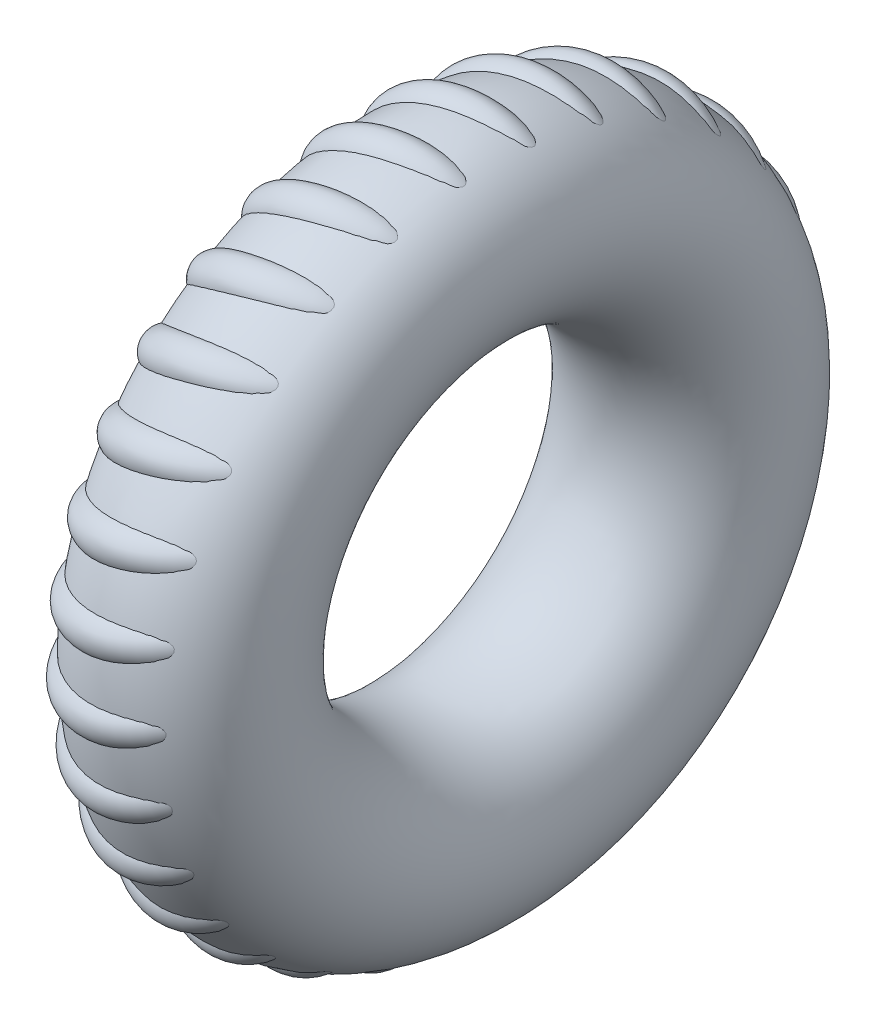
ISO-10303-21;
HEADER;
FILE_DESCRIPTION(('STEP AP214'),'2;1');
FILE_NAME('part.step','',(''),(''),'','','');
FILE_SCHEMA(('AUTOMOTIVE_DESIGN { 1 0 10303 214 1 1 1 1 }'));
ENDSEC;
DATA;
#1=APPLICATION_CONTEXT('core data for automotive mechanical design processes');
#2=APPLICATION_PROTOCOL_DEFINITION('international standard','automotive_design',2000,#1);
#3=PRODUCT_CONTEXT('',#1,'mechanical');
#4=PRODUCT('Part','Part','',(#3));
#5=PRODUCT_RELATED_PRODUCT_CATEGORY('part','',(#4));
#6=PRODUCT_DEFINITION_FORMATION('','',#4);
#7=PRODUCT_DEFINITION_CONTEXT('part definition',#1,'design');
#8=PRODUCT_DEFINITION('design','',#6,#7);
#9=PRODUCT_DEFINITION_SHAPE('','',#8);
#10=(LENGTH_UNIT() NAMED_UNIT(*) SI_UNIT(.MILLI.,.METRE.));
#11=(NAMED_UNIT(*) PLANE_ANGLE_UNIT() SI_UNIT($,.RADIAN.));
#12=(NAMED_UNIT(*) SI_UNIT($,.STERADIAN.) SOLID_ANGLE_UNIT());
#13=UNCERTAINTY_MEASURE_WITH_UNIT(LENGTH_MEASURE(1.E-05),#10,'distance_accuracy_value','');
#14=(GEOMETRIC_REPRESENTATION_CONTEXT(3) GLOBAL_UNCERTAINTY_ASSIGNED_CONTEXT((#13)) GLOBAL_UNIT_ASSIGNED_CONTEXT((#10,
#11,#12)) REPRESENTATION_CONTEXT('',''));
#15=CARTESIAN_POINT('',(0.,0.,0.));
#16=DIRECTION('',(0.,0.,1.));
#17=DIRECTION('',(1.,0.,0.));
#18=AXIS2_PLACEMENT_3D('',#15,#16,#17);
#19=CARTESIAN_POINT('',(-0.0197356871410223,0.807315676540403,-0.286027395869337));
#20=DIRECTION('',(0.171928492592131,0.0654062565493844,0.982935712566795));
#21=DIRECTION('',(-0.0243779212002063,-0.997205374978752,0.0706198065095223));
#22=AXIS2_PLACEMENT_3D('',#19,#20,#21);
#23=TOROIDAL_SURFACE('',#22,0.234974875549106,0.0673045788176516);
#24=CARTESIAN_POINT('',(-0.0271046318600165,0.505880979900229,-0.264680479290153));
#25=VERTEX_POINT('',#24);
#26=VERTEX_LOOP('',#25);
#27=FACE_BOUND('',#26,.T.);
#28=ADVANCED_FACE('F43',(#27),#23,.T.);
#29=CLOSED_SHELL('',(#28));
#30=MANIFOLD_SOLID_BREP('B2',#29);
#31=CARTESIAN_POINT('',(-0.0197356871410223,0.73020545254739,-0.447627378346929));
#32=DIRECTION('',(0.171928492592131,0.268340798881682,0.947857483533542));
#33=DIRECTION('',(-0.0243779212002063,-0.960731361597704,0.276407249905965));
#34=AXIS2_PLACEMENT_3D('',#31,#32,#33);
#35=TOROIDAL_SURFACE('',#34,0.234974875549106,0.0673045788176516);
#36=CARTESIAN_POINT('',(-0.0271046318600165,0.439796100770604,-0.364075145662338));
#37=VERTEX_POINT('',#36);
#38=VERTEX_LOOP('',#37);
#39=FACE_BOUND('',#38,.T.);
#40=ADVANCED_FACE('F65',(#39),#35,.T.);
#41=CLOSED_SHELL('',(#40));
#42=MANIFOLD_SOLID_BREP('B6',#41);
#43=CARTESIAN_POINT('',(-0.0197356871410223,0.621181746363541,-0.589663896436288));
#44=DIRECTION('',(0.171928492592131,0.459547560660835,0.871353334145038));
#45=DIRECTION('',(-0.0243779212002063,-0.88226877761428,0.470114370132376));
#46=AXIS2_PLACEMENT_3D('',#43,#44,#45);
#47=TOROIDAL_SURFACE('',#46,0.234974875549106,0.0673045788176516);
#48=CARTESIAN_POINT('',(-0.0271046318600165,0.354490021661471,-0.447557981142701));
#49=VERTEX_POINT('',#48);
#50=VERTEX_LOOP('',#49);
#51=FACE_BOUND('',#50,.T.);
#52=ADVANCED_FACE('F87',(#51),#47,.T.);
#53=CLOSED_SHELL('',(#52));
#54=MANIFOLD_SOLID_BREP('B39',#53);
#55=CARTESIAN_POINT('',(-0.0197356871410223,0.485009417102876,-0.705929272730074));
#56=DIRECTION('',(0.171928492592131,0.630669888885256,0.7567668628372));
#57=DIRECTION('',(-0.0243779212002063,-0.765246814453807,0.643275236524971));
#58=AXIS2_PLACEMENT_3D('',#55,#56,#57);
#59=TOROIDAL_SURFACE('',#58,0.234974875549106,0.0673045788176516);
#60=CARTESIAN_POINT('',(-0.0271046318600165,0.253691027573881,-0.511480385225659));
#61=VERTEX_POINT('',#60);
#62=VERTEX_LOOP('',#61);
#63=FACE_BOUND('',#62,.T.);
#64=ADVANCED_FACE('F109',(#63),#59,.T.);
#65=CLOSED_SHELL('',(#64));
#66=MANIFOLD_SOLID_BREP('B61',#65);
#67=CARTESIAN_POINT('',(-0.0197356871410223,0.327639848981419,-0.791342152381078));
#68=DIRECTION('',(0.171928492592131,0.774228916675503,0.609106048253073));
#69=DIRECTION('',(-0.0243779212002063,-0.614779893440078,0.788321888304367));
#70=AXIS2_PLACEMENT_3D('',#67,#68,#69);
#71=TOROIDAL_SURFACE('',#70,0.234974875549106,0.0673045788176516);
#72=CARTESIAN_POINT('',(-0.0271046318600165,0.141804518236699,-0.553048642119062));
#73=VERTEX_POINT('',#72);
#74=VERTEX_LOOP('',#73);
#75=FACE_BOUND('',#74,.T.);
#76=ADVANCED_FACE('F131',(#75),#71,.T.);
#77=CLOSED_SHELL('',(#76));
#78=MANIFOLD_SOLID_BREP('B83',#77);
#79=CARTESIAN_POINT('',(-0.0197356871410223,0.155950847269046,-0.842169582692079));
#80=DIRECTION('',(0.171928492592131,0.883950425644497,0.434824376545187));
#81=DIRECTION('',(-0.0243779212002063,-0.437444141041786,0.898915090776749));
#82=AXIS2_PLACEMENT_3D('',#79,#80,#81);
#83=TOROIDAL_SURFACE('',#82,0.234974875549106,0.0673045788176516);
#84=CARTESIAN_POINT('',(-0.0271046318600165,0.0237204709989997,-0.570446019530039));
#85=VERTEX_POINT('',#84);
#86=VERTEX_LOOP('',#85);
#87=FACE_BOUND('',#86,.T.);
#88=ADVANCED_FACE('F153',(#87),#83,.T.);
#89=CLOSED_SHELL('',(#88));
#90=MANIFOLD_SOLID_BREP('B105',#89);
#91=CARTESIAN_POINT('',(-0.0197356871410223,-0.0225539548041761,-0.856190161061417));
#92=DIRECTION('',(0.171928492592131,0.955039059348079,0.241538793063421));
#93=DIRECTION('',(-0.0243779212002063,-0.24098998059009,0.970221390309008));
#94=AXIS2_PLACEMENT_3D('',#91,#92,#93);
#95=TOROIDAL_SURFACE('',#94,0.234974875549106,0.0673045788176516);
#96=CARTESIAN_POINT('',(-0.0271046318600165,-0.0954002746448038,-0.562912168583853));
#97=VERTEX_POINT('',#96);
#98=VERTEX_LOOP('',#97);
#99=FACE_BOUND('',#98,.T.);
#100=ADVANCED_FACE('F175',(#99),#95,.T.);
#101=CLOSED_SHELL('',(#100));
#102=MANIFOLD_SOLID_BREP('B127',#101);
#103=CARTESIAN_POINT('',(-0.0197356871410223,-0.200073040826573,-0.832791120936152));
#104=DIRECTION('',(0.171928492592131,0.984387903372291,0.037696805293063));
#105=DIRECTION('',(-0.0243779212002063,-0.0340034015883794,0.999124359445998));
#106=AXIS2_PLACEMENT_3D('',#103,#104,#105);
#107=TOROIDAL_SURFACE('',#106,0.234974875549106,0.0673045788176516);
#108=CARTESIAN_POINT('',(-0.0271046318600165,-0.210351570505322,-0.53077635471828));
#109=VERTEX_POINT('',#108);
#110=VERTEX_LOOP('',#109);
#111=FACE_BOUND('',#110,.T.);
#112=ADVANCED_FACE('F197',(#111),#107,.T.);
#113=CLOSED_SHELL('',(#112));
#114=MANIFOLD_SOLID_BREP('B149',#113);
#115=CARTESIAN_POINT('',(-0.0197356871410223,-0.368847974907881,-0.77299511265081));
#116=DIRECTION('',(0.171928492592131,0.970714272401896,-0.167792713757943));
#117=DIRECTION('',(-0.0243779212002063,0.174469289229167,0.984360799744599));
#118=AXIS2_PLACEMENT_3D('',#115,#116,#117);
#119=TOROIDAL_SURFACE('',#118,0.234974875549106,0.0673045788176516);
#120=CARTESIAN_POINT('',(-0.0271046318600165,-0.316109493355933,-0.475443067203988));
#121=VERTEX_POINT('',#120);
#122=VERTEX_LOOP('',#121);
#123=FACE_BOUND('',#122,.T.);
#124=ADVANCED_FACE('F219',(#123),#119,.T.);
#125=CLOSED_SHELL('',(#124));
#126=MANIFOLD_SOLID_BREP('B171',#125);
#127=CARTESIAN_POINT('',(-0.0197356871410223,-0.521502482556762,-0.679415508700543));
#128=DIRECTION('',(0.171928492592131,0.914615769723662,-0.365948886058956));
#129=DIRECTION('',(-0.0243779212002063,0.375316834910864,0.92657594960718));
#130=AXIS2_PLACEMENT_3D('',#127,#128,#129);
#131=TOROIDAL_SURFACE('',#130,0.234974875549106,0.0673045788176516);
#132=CARTESIAN_POINT('',(-0.0271046318600165,-0.408051914485247,-0.399330636223925));
#133=VERTEX_POINT('',#132);
#134=VERTEX_LOOP('',#133);
#135=FACE_BOUND('',#134,.T.);
#136=ADVANCED_FACE('F241',(#135),#131,.T.);
#137=CLOSED_SHELL('',(#136));
#138=MANIFOLD_SOLID_BREP('B193',#137);
#139=CARTESIAN_POINT('',(-0.0197356871410223,-0.651364829271358,-0.556142186822739));
#140=DIRECTION('',(0.171928492592131,0.81854416909511,-0.54811133602161));
#141=DIRECTION('',(-0.0243779212002063,0.559761233936968,0.828295284267223));
#142=AXIS2_PLACEMENT_3D('',#139,#140,#141);
#143=TOROIDAL_SURFACE('',#142,0.234974875549106,0.0673045788176516);
#144=CARTESIAN_POINT('',(-0.0271046318600165,-0.482160508901229,-0.305765540239885));
#145=VERTEX_POINT('',#144);
#146=VERTEX_LOOP('',#145);
#147=FACE_BOUND('',#146,.T.);
#148=ADVANCED_FACE('F263',(#147),#143,.T.);
#149=CLOSED_SHELL('',(#148));
#150=MANIFOLD_SOLID_BREP('B215',#149);
#151=CARTESIAN_POINT('',(-0.0197356871410223,-0.752759407351566,-0.408562782714484));
#152=DIRECTION('',(0.171928492592131,0.686698260466394,-0.706318690470121));
#153=DIRECTION('',(-0.0243779212002063,0.719741381007615,0.693814140403039));
#154=AXIS2_PLACEMENT_3D('',#151,#152,#153);
#155=TOROIDAL_SURFACE('',#154,0.234974875549106,0.0673045788176516);
#156=CARTESIAN_POINT('',(-0.0271046318600165,-0.535196375415408,-0.198837022921513));
#157=VERTEX_POINT('',#156);
#158=VERTEX_LOOP('',#157);
#159=FACE_BOUND('',#158,.T.);
#160=ADVANCED_FACE('F285',(#159),#155,.T.);
#161=CLOSED_SHELL('',(#160));
#162=MANIFOLD_SOLID_BREP('B237',#161);
#163=CARTESIAN_POINT('',(-0.0197356871410223,-0.821254787190113,-0.243127224499861));
#164=DIRECTION('',(0.171928492592131,0.524840342711452,-0.833656528851975));
#165=DIRECTION('',(-0.0243779212002063,0.848265376025901,0.529009989313618));
#166=AXIS2_PLACEMENT_3D('',#163,#164,#165);
#167=TOROIDAL_SURFACE('',#166,0.234974875549106,0.0673045788176516);
#168=CARTESIAN_POINT('',(-0.0271046318600165,-0.564841592166792,-0.0832183735755766));
#169=VERTEX_POINT('',#168);
#170=VERTEX_LOOP('',#169);
#171=FACE_BOUND('',#170,.T.);
#172=ADVANCED_FACE('F307',(#171),#167,.T.);
#173=CLOSED_SHELL('',(#172));
#174=MANIFOLD_SOLID_BREP('B259',#173);
#175=CARTESIAN_POINT('',(-0.0197356871410223,-0.853857392010756,-0.0670658399207326));
#176=DIRECTION('',(0.171928492592131,0.340044383516636,-0.924559576595142));
#177=DIRECTION('',(-0.0243779212002063,0.939716103682973,0.341085563219624));
#178=AXIS2_PLACEMENT_3D('',#175,#176,#177);
#179=TOROIDAL_SURFACE('',#178,0.234974875549106,0.0673045788176516);
#180=CARTESIAN_POINT('',(-0.0271046318600165,-0.569800520929812,0.0360373180216733));
#181=VERTEX_POINT('',#180);
#182=VERTEX_LOOP('',#181);
#183=FACE_BOUND('',#182,.T.);
#184=ADVANCED_FACE('F329',(#183),#179,.T.);
#185=CLOSED_SHELL('',(#184));
#186=MANIFOLD_SOLID_BREP('B281',#185);
#187=CARTESIAN_POINT('',(-0.0197356871410223,-0.849142331538178,0.111926643680543));
#188=DIRECTION('',(0.171928492592131,0.140386853048149,-0.975054934312029));
#189=DIRECTION('',(-0.0243779212002063,0.990096728350941,0.138254061302803));
#190=AXIS2_PLACEMENT_3D('',#187,#188,#189);
#191=TOROIDAL_SURFACE('',#190,0.234974875549106,0.0673045788176516);
#192=CARTESIAN_POINT('',(-0.0271046318600165,-0.549856432721944,0.153718005895142));
#193=VERTEX_POINT('',#192);
#194=VERTEX_LOOP('',#193);
#195=FACE_BOUND('',#194,.T.);
#196=ADVANCED_FACE('F351',(#195),#191,.T.);
#197=CLOSED_SHELL('',(#196));
#198=MANIFOLD_SOLID_BREP('B303',#197);
#199=CARTESIAN_POINT('',(-0.0197356871410223,-0.807315676540401,0.286027395869342));
#200=DIRECTION('',(0.171928492592131,-0.0654062565493908,-0.982935712566795));
#201=DIRECTION('',(-0.0243779212002063,0.997205374978752,-0.0706198065095288));
#202=AXIS2_PLACEMENT_3D('',#199,#200,#201);
#203=TOROIDAL_SURFACE('',#202,0.234974875549106,0.0673045788176516);
#204=CARTESIAN_POINT('',(-0.0271046318600165,-0.505880979900227,0.264680479290156));
#205=VERTEX_POINT('',#204);
#206=VERTEX_LOOP('',#205);
#207=FACE_BOUND('',#206,.T.);
#208=ADVANCED_FACE('F373',(#207),#203,.T.);
#209=CLOSED_SHELL('',(#208));
#210=MANIFOLD_SOLID_BREP('B325',#209);
#211=CARTESIAN_POINT('',(-0.0197356871410223,-0.730205452547387,0.447627378346934));
#212=DIRECTION('',(0.171928492592131,-0.268340798881688,-0.94785748353354));
#213=DIRECTION('',(-0.0243779212002063,0.960731361597702,-0.276407249905972));
#214=AXIS2_PLACEMENT_3D('',#211,#212,#213);
#215=TOROIDAL_SURFACE('',#214,0.234974875549106,0.0673045788176516);
#216=CARTESIAN_POINT('',(-0.0271046318600165,-0.439796100770602,0.364075145662341));
#217=VERTEX_POINT('',#216);
#218=VERTEX_LOOP('',#217);
#219=FACE_BOUND('',#218,.T.);
#220=ADVANCED_FACE('F395',(#219),#215,.T.);
#221=CLOSED_SHELL('',(#220));
#222=MANIFOLD_SOLID_BREP('B347',#221);
#223=CARTESIAN_POINT('',(-0.0197356871410223,-0.621181746363537,0.589663896436292));
#224=DIRECTION('',(0.171928492592131,-0.459547560660841,-0.871353334145035));
#225=DIRECTION('',(-0.0243779212002063,0.882268777614277,-0.470114370132383));
#226=AXIS2_PLACEMENT_3D('',#223,#224,#225);
#227=TOROIDAL_SURFACE('',#226,0.234974875549106,0.0673045788176516);
#228=CARTESIAN_POINT('',(-0.0271046318600165,-0.354490021661468,0.447557981142703));
#229=VERTEX_POINT('',#228);
#230=VERTEX_LOOP('',#229);
#231=FACE_BOUND('',#230,.T.);
#232=ADVANCED_FACE('F417',(#231),#227,.T.);
#233=CLOSED_SHELL('',(#232));
#234=MANIFOLD_SOLID_BREP('B369',#233);
#235=CARTESIAN_POINT('',(-0.0197356871410223,-0.485009417102871,0.705929272730078));
#236=DIRECTION('',(0.171928492592131,-0.630669888885261,-0.756766862837195));
#237=DIRECTION('',(-0.0243779212002063,0.765246814453803,-0.643275236524976));
#238=AXIS2_PLACEMENT_3D('',#235,#236,#237);
#239=TOROIDAL_SURFACE('',#238,0.234974875549106,0.0673045788176516);
#240=CARTESIAN_POINT('',(-0.0271046318600165,-0.253691027573877,0.511480385225661));
#241=VERTEX_POINT('',#240);
#242=VERTEX_LOOP('',#241);
#243=FACE_BOUND('',#242,.T.);
#244=ADVANCED_FACE('F439',(#243),#239,.T.);
#245=CLOSED_SHELL('',(#244));
#246=MANIFOLD_SOLID_BREP('B391',#245);
#247=CARTESIAN_POINT('',(-0.0197356871410223,-0.327639848981413,0.79134215238108));
#248=DIRECTION('',(0.171928492592131,-0.774228916675507,-0.609106048253068));
#249=DIRECTION('',(-0.0243779212002063,0.614779893440073,-0.788321888304372));
#250=AXIS2_PLACEMENT_3D('',#247,#248,#249);
#251=TOROIDAL_SURFACE('',#250,0.234974875549106,0.0673045788176516);
#252=CARTESIAN_POINT('',(-0.0271046318600165,-0.141804518236695,0.553048642119063));
#253=VERTEX_POINT('',#252);
#254=VERTEX_LOOP('',#253);
#255=FACE_BOUND('',#254,.T.);
#256=ADVANCED_FACE('F461',(#255),#251,.T.);
#257=CLOSED_SHELL('',(#256));
#258=MANIFOLD_SOLID_BREP('B413',#257);
#259=CARTESIAN_POINT('',(-0.0197356871410223,-0.15595084726904,0.84216958269208));
#260=DIRECTION('',(0.171928492592131,-0.8839504256445,-0.434824376545181));
#261=DIRECTION('',(-0.0243779212002063,0.437444141041781,-0.898915090776752));
#262=AXIS2_PLACEMENT_3D('',#259,#260,#261);
#263=TOROIDAL_SURFACE('',#262,0.234974875549106,0.0673045788176516);
#264=CARTESIAN_POINT('',(-0.0271046318600165,-0.0237204709989961,0.57044601953004));
#265=VERTEX_POINT('',#264);
#266=VERTEX_LOOP('',#265);
#267=FACE_BOUND('',#266,.T.);
#268=ADVANCED_FACE('F483',(#267),#263,.T.);
#269=CLOSED_SHELL('',(#268));
#270=MANIFOLD_SOLID_BREP('B435',#269);
#271=CARTESIAN_POINT('',(-0.0197356871410223,0.0225539548041817,0.856190161061417));
#272=DIRECTION('',(0.171928492592131,-0.955039059348081,-0.241538793063415));
#273=DIRECTION('',(-0.0243779212002063,0.240989980590084,-0.97022139030901));
#274=AXIS2_PLACEMENT_3D('',#271,#272,#273);
#275=TOROIDAL_SURFACE('',#274,0.234974875549106,0.0673045788176516);
#276=CARTESIAN_POINT('',(-0.0271046318600165,0.0954002746448075,0.562912168583853));
#277=VERTEX_POINT('',#276);
#278=VERTEX_LOOP('',#277);
#279=FACE_BOUND('',#278,.T.);
#280=ADVANCED_FACE('F505',(#279),#275,.T.);
#281=CLOSED_SHELL('',(#280));
#282=MANIFOLD_SOLID_BREP('B457',#281);
#283=CARTESIAN_POINT('',(-0.0197356871410223,0.200073040826578,0.832791120936151));
#284=DIRECTION('',(0.171928492592131,-0.984387903372291,-0.0376968052930563));
#285=DIRECTION('',(-0.0243779212002063,0.0340034015883727,-0.999124359445999));
#286=AXIS2_PLACEMENT_3D('',#283,#284,#285);
#287=TOROIDAL_SURFACE('',#286,0.234974875549106,0.0673045788176516);
#288=CARTESIAN_POINT('',(-0.0271046318600165,0.210351570505325,0.530776354718278));
#289=VERTEX_POINT('',#288);
#290=VERTEX_LOOP('',#289);
#291=FACE_BOUND('',#290,.T.);
#292=ADVANCED_FACE('F527',(#291),#287,.T.);
#293=CLOSED_SHELL('',(#292));
#294=MANIFOLD_SOLID_BREP('B479',#293);
#295=CARTESIAN_POINT('',(-0.0197356871410223,0.368847974907887,0.772995112650808));
#296=DIRECTION('',(0.171928492592131,-0.970714272401895,0.16779271375795));
#297=DIRECTION('',(-0.0243779212002063,-0.174469289229174,-0.984360799744598));
#298=AXIS2_PLACEMENT_3D('',#295,#296,#297);
#299=TOROIDAL_SURFACE('',#298,0.234974875549106,0.0673045788176516);
#300=CARTESIAN_POINT('',(-0.0271046318600165,0.316109493355936,0.475443067203986));
#301=VERTEX_POINT('',#300);
#302=VERTEX_LOOP('',#301);
#303=FACE_BOUND('',#302,.T.);
#304=ADVANCED_FACE('F549',(#303),#299,.T.);
#305=CLOSED_SHELL('',(#304));
#306=MANIFOLD_SOLID_BREP('B501',#305);
#307=CARTESIAN_POINT('',(-0.0197356871410223,0.521502482556766,0.67941550870054));
#308=DIRECTION('',(0.171928492592131,-0.91461576972366,0.365948886058963));
#309=DIRECTION('',(-0.0243779212002063,-0.37531683491087,-0.926575949607178));
#310=AXIS2_PLACEMENT_3D('',#307,#308,#309);
#311=TOROIDAL_SURFACE('',#310,0.234974875549106,0.0673045788176516);
#312=CARTESIAN_POINT('',(-0.0271046318600165,0.40805191448525,0.399330636223922));
#313=VERTEX_POINT('',#312);
#314=VERTEX_LOOP('',#313);
#315=FACE_BOUND('',#314,.T.);
#316=ADVANCED_FACE('F571',(#315),#311,.T.);
#317=CLOSED_SHELL('',(#316));
#318=MANIFOLD_SOLID_BREP('B523',#317);
#319=CARTESIAN_POINT('',(-0.0197356871410223,0.651364829271362,0.556142186822734));
#320=DIRECTION('',(0.171928492592131,-0.818544169095106,0.548111336021616));
#321=DIRECTION('',(-0.0243779212002063,-0.559761233936973,-0.828295284267219));
#322=AXIS2_PLACEMENT_3D('',#319,#320,#321);
#323=TOROIDAL_SURFACE('',#322,0.234974875549106,0.0673045788176516);
#324=CARTESIAN_POINT('',(-0.0271046318600165,0.482160508901231,0.305765540239881));
#325=VERTEX_POINT('',#324);
#326=VERTEX_LOOP('',#325);
#327=FACE_BOUND('',#326,.T.);
#328=ADVANCED_FACE('F593',(#327),#323,.T.);
#329=CLOSED_SHELL('',(#328));
#330=MANIFOLD_SOLID_BREP('B545',#329);
#331=CARTESIAN_POINT('',(-0.0197356871410223,0.752759407351569,0.408562782714479));
#332=DIRECTION('',(0.171928492592131,-0.686698260466389,0.706318690470126));
#333=DIRECTION('',(-0.0243779212002063,-0.71974138100762,-0.693814140403034));
#334=AXIS2_PLACEMENT_3D('',#331,#332,#333);
#335=TOROIDAL_SURFACE('',#334,0.234974875549106,0.0673045788176516);
#336=CARTESIAN_POINT('',(-0.0271046318600165,0.535196375415409,0.198837022921509));
#337=VERTEX_POINT('',#336);
#338=VERTEX_LOOP('',#337);
#339=FACE_BOUND('',#338,.T.);
#340=ADVANCED_FACE('F615',(#339),#335,.T.);
#341=CLOSED_SHELL('',(#340));
#342=MANIFOLD_SOLID_BREP('B567',#341);
#343=CARTESIAN_POINT('',(-0.0197356871410223,0.821254787190115,0.243127224499855));
#344=DIRECTION('',(0.171928492592131,-0.524840342711446,0.833656528851978));
#345=DIRECTION('',(-0.0243779212002063,-0.848265376025904,-0.529009989313612));
#346=AXIS2_PLACEMENT_3D('',#343,#344,#345);
#347=TOROIDAL_SURFACE('',#346,0.234974875549106,0.0673045788176516);
#348=CARTESIAN_POINT('',(-0.0271046318600165,0.564841592166792,0.0832183735755728));
#349=VERTEX_POINT('',#348);
#350=VERTEX_LOOP('',#349);
#351=FACE_BOUND('',#350,.T.);
#352=ADVANCED_FACE('F637',(#351),#347,.T.);
#353=CLOSED_SHELL('',(#352));
#354=MANIFOLD_SOLID_BREP('B589',#353);
#355=CARTESIAN_POINT('',(-0.0197356871410223,0.853857392010757,0.0670658399207268));
#356=DIRECTION('',(0.171928492592131,-0.34004438351663,0.924559576595145));
#357=DIRECTION('',(-0.0243779212002063,-0.939716103682976,-0.341085563219617));
#358=AXIS2_PLACEMENT_3D('',#355,#356,#357);
#359=TOROIDAL_SURFACE('',#358,0.234974875549106,0.0673045788176516);
#360=CARTESIAN_POINT('',(-0.0271046318600165,0.569800520929812,-0.0360373180216772));
#361=VERTEX_POINT('',#360);
#362=VERTEX_LOOP('',#361);
#363=FACE_BOUND('',#362,.T.);
#364=ADVANCED_FACE('F659',(#363),#359,.T.);
#365=CLOSED_SHELL('',(#364));
#366=MANIFOLD_SOLID_BREP('B611',#365);
#367=CARTESIAN_POINT('',(-0.0197356871410223,0.849142331538178,-0.111926643680543));
#368=DIRECTION('',(0.171928492592131,-0.140386853048149,0.975054934312029));
#369=DIRECTION('',(-0.0243779212002063,-0.990096728350941,-0.138254061302803));
#370=AXIS2_PLACEMENT_3D('',#367,#368,#369);
#371=TOROIDAL_SURFACE('',#370,0.234974875549106,0.0673045788176516);
#372=CARTESIAN_POINT('',(-0.0271046318600165,0.549856432721944,-0.153718005895142));
#373=VERTEX_POINT('',#372);
#374=VERTEX_LOOP('',#373);
#375=FACE_BOUND('',#374,.T.);
#376=ADVANCED_FACE('F681',(#375),#371,.T.);
#377=CLOSED_SHELL('',(#376));
#378=MANIFOLD_SOLID_BREP('B633',#377);
#379=CARTESIAN_POINT('',(0.,0.818475865858184,0.));
#380=DIRECTION('',(0.,0.,-1.));
#381=DIRECTION('',(0.864501466631609,0.502630295736138,0.));
#382=AXIS2_PLACEMENT_3D('',#379,#380,#381);
#383=ELLIPSE('',#382,0.321785299721557,0.306558502350494);
#384=CARTESIAN_POINT('',(0.318007281677431,0.,0.));
#385=DIRECTION('',(-1.,0.,0.));
#386=AXIS1_PLACEMENT('',#384,#385);
#387=SURFACE_OF_REVOLUTION('',#383,#386);
#388=ADVANCED_FACE('F695',(),#387,.F.);
#389=CLOSED_SHELL('',(#388));
#390=MANIFOLD_SOLID_BREP('B655_NOT_SHOWN',#389);
#391=ADVANCED_BREP_SHAPE_REPRESENTATION('',(#18,#30,#42,#54,#66,#78,#90,#102,#114,#126,#138,
#150,#162,#174,#186,#198,#210,#222,#234,#246,#258,#270,#282,#294,#306,#318,#330,#342,#354,#366,
#378,#390),#14);
#392=SHAPE_DEFINITION_REPRESENTATION(#9,#391);
ENDSEC;
END-ISO-10303-21;
